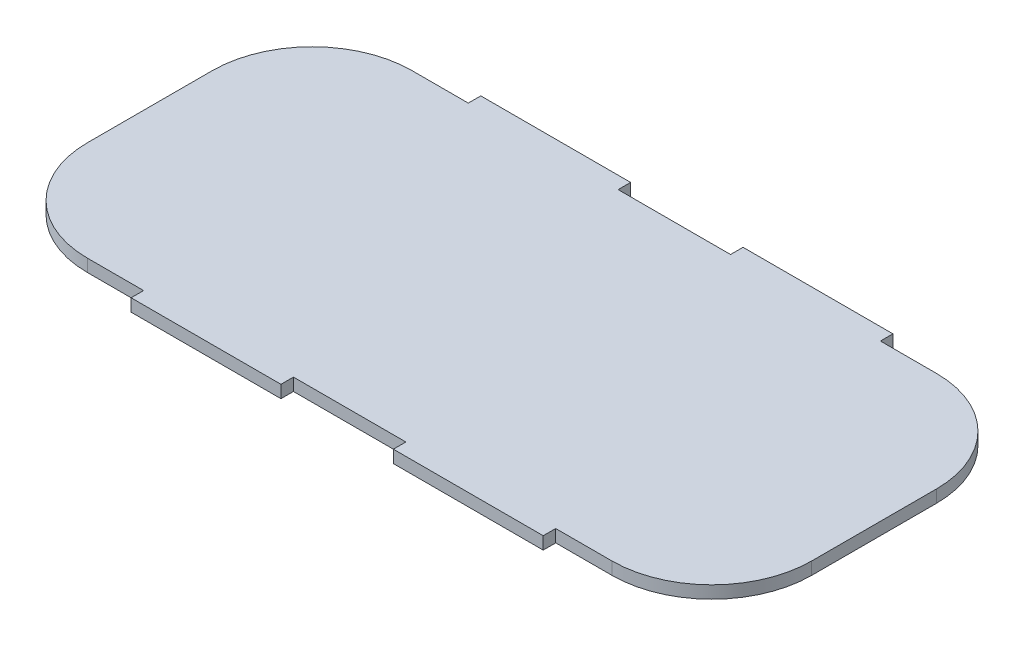
ISO-10303-21;
HEADER;
FILE_DESCRIPTION(('STEP AP214'),'2;1');
FILE_NAME('part.step','',(''),(''),'','','');
FILE_SCHEMA(('AUTOMOTIVE_DESIGN { 1 0 10303 214 1 1 1 1 }'));
ENDSEC;
DATA;
#1=APPLICATION_CONTEXT('core data for automotive mechanical design processes');
#2=APPLICATION_PROTOCOL_DEFINITION('international standard','automotive_design',2000,#1);
#3=PRODUCT_CONTEXT('',#1,'mechanical');
#4=PRODUCT('Part','Part','',(#3));
#5=PRODUCT_RELATED_PRODUCT_CATEGORY('part','',(#4));
#6=PRODUCT_DEFINITION_FORMATION('','',#4);
#7=PRODUCT_DEFINITION_CONTEXT('part definition',#1,'design');
#8=PRODUCT_DEFINITION('design','',#6,#7);
#9=PRODUCT_DEFINITION_SHAPE('','',#8);
#10=(LENGTH_UNIT() NAMED_UNIT(*) SI_UNIT(.MILLI.,.METRE.));
#11=(NAMED_UNIT(*) PLANE_ANGLE_UNIT() SI_UNIT($,.RADIAN.));
#12=(NAMED_UNIT(*) SI_UNIT($,.STERADIAN.) SOLID_ANGLE_UNIT());
#13=UNCERTAINTY_MEASURE_WITH_UNIT(LENGTH_MEASURE(1.E-05),#10,'distance_accuracy_value','');
#14=(GEOMETRIC_REPRESENTATION_CONTEXT(3) GLOBAL_UNCERTAINTY_ASSIGNED_CONTEXT((#13)) GLOBAL_UNIT_ASSIGNED_CONTEXT((#10,
#11,#12)) REPRESENTATION_CONTEXT('',''));
#15=CARTESIAN_POINT('',(0.,0.,0.));
#16=DIRECTION('',(0.,0.,1.));
#17=DIRECTION('',(1.,0.,0.));
#18=AXIS2_PLACEMENT_3D('',#15,#16,#17);
#19=CARTESIAN_POINT('',(52.5,2.5,-12.5));
#20=DIRECTION('',(0.,-1.,0.));
#21=DIRECTION('',(0.,0.,-1.));
#22=AXIS2_PLACEMENT_3D('',#19,#20,#21);
#23=CYLINDRICAL_SURFACE('',#22,20.);
#24=CARTESIAN_POINT('',(52.5,0.,-12.5));
#25=DIRECTION('',(0.,1.,0.));
#26=DIRECTION('',(0.,0.,-1.));
#27=AXIS2_PLACEMENT_3D('',#24,#25,#26);
#28=CIRCLE('',#27,20.);
#29=CARTESIAN_POINT('',(72.5,0.,-12.4999999999999));
#30=VERTEX_POINT('',#29);
#31=CARTESIAN_POINT('',(52.4999999999998,0.,-32.5));
#32=VERTEX_POINT('',#31);
#33=EDGE_CURVE('E236',#30,#32,#28,.T.);
#34=ORIENTED_EDGE('',*,*,#33,.T.);
#35=DIRECTION('',(0.,-1.,0.));
#36=VECTOR('',#35,1.);
#37=CARTESIAN_POINT('',(52.4999999999998,2.5,-32.5));
#38=LINE('',#37,#36);
#39=CARTESIAN_POINT('',(52.4999999999998,2.5,-32.5));
#40=VERTEX_POINT('',#39);
#41=EDGE_CURVE('E11',#40,#32,#38,.T.);
#42=ORIENTED_EDGE('',*,*,#41,.F.);
#43=CARTESIAN_POINT('',(52.5,2.5,-12.5));
#44=DIRECTION('',(0.,1.,0.));
#45=DIRECTION('',(0.,0.,-1.));
#46=AXIS2_PLACEMENT_3D('',#43,#44,#45);
#47=CIRCLE('',#46,20.);
#48=CARTESIAN_POINT('',(72.5,2.5,-12.4999999999999));
#49=VERTEX_POINT('',#48);
#50=EDGE_CURVE('E306',#49,#40,#47,.T.);
#51=ORIENTED_EDGE('',*,*,#50,.F.);
#52=DIRECTION('',(0.,-1.,0.));
#53=VECTOR('',#52,1.);
#54=CARTESIAN_POINT('',(72.5,2.5,-12.4999999999999));
#55=LINE('',#54,#53);
#56=EDGE_CURVE('E232',#49,#30,#55,.T.);
#57=ORIENTED_EDGE('',*,*,#56,.T.);
#58=EDGE_LOOP('',(#34,#42,#51,#57));
#59=FACE_BOUND('',#58,.T.);
#60=ADVANCED_FACE('F39',(#59),#23,.T.);
#61=CARTESIAN_POINT('',(41.2499999999997,2.5,-32.5));
#62=DIRECTION('',(0.,0.,1.));
#63=DIRECTION('',(1.,0.,0.));
#64=AXIS2_PLACEMENT_3D('',#61,#62,#63);
#65=PLANE('',#64);
#66=DIRECTION('',(-1.,0.,0.));
#67=VECTOR('',#66,1.);
#68=CARTESIAN_POINT('',(41.2499999999997,0.,-32.5));
#69=LINE('',#68,#67);
#70=CARTESIAN_POINT('',(41.2499999999997,0.,-32.5));
#71=VERTEX_POINT('',#70);
#72=EDGE_CURVE('E240',#32,#71,#69,.T.);
#73=ORIENTED_EDGE('',*,*,#72,.T.);
#74=DIRECTION('',(0.,-1.,0.));
#75=VECTOR('',#74,1.);
#76=CARTESIAN_POINT('',(41.2499999999997,2.5,-32.5));
#77=LINE('',#76,#75);
#78=CARTESIAN_POINT('',(41.2499999999997,2.5,-32.5));
#79=VERTEX_POINT('',#78);
#80=EDGE_CURVE('E48',#79,#71,#77,.T.);
#81=ORIENTED_EDGE('',*,*,#80,.F.);
#82=DIRECTION('',(-1.,0.,0.));
#83=VECTOR('',#82,1.);
#84=CARTESIAN_POINT('',(41.2499999999997,2.5,-32.5));
#85=LINE('',#84,#83);
#86=EDGE_CURVE('E147',#40,#79,#85,.T.);
#87=ORIENTED_EDGE('',*,*,#86,.F.);
#88=ORIENTED_EDGE('',*,*,#41,.T.);
#89=EDGE_LOOP('',(#73,#81,#87,#88));
#90=FACE_BOUND('',#89,.T.);
#91=ADVANCED_FACE('F484',(#90),#65,.F.);
#92=CARTESIAN_POINT('',(41.2499999999997,2.5,-35.0000000000003));
#93=DIRECTION('',(-1.,0.,0.));
#94=DIRECTION('',(0.,0.,1.));
#95=AXIS2_PLACEMENT_3D('',#92,#93,#94);
#96=PLANE('',#95);
#97=DIRECTION('',(0.,0.,-1.));
#98=VECTOR('',#97,1.);
#99=CARTESIAN_POINT('',(41.2499999999997,0.,-35.0000000000003));
#100=LINE('',#99,#98);
#101=CARTESIAN_POINT('',(41.2499999999997,0.,-35.0000000000003));
#102=VERTEX_POINT('',#101);
#103=EDGE_CURVE('E243',#71,#102,#100,.T.);
#104=ORIENTED_EDGE('',*,*,#103,.T.);
#105=DIRECTION('',(0.,-1.,0.));
#106=VECTOR('',#105,1.);
#107=CARTESIAN_POINT('',(41.2499999999997,2.5,-35.0000000000003));
#108=LINE('',#107,#106);
#109=CARTESIAN_POINT('',(41.2499999999997,2.5,-35.0000000000003));
#110=VERTEX_POINT('',#109);
#111=EDGE_CURVE('E381',#110,#102,#108,.T.);
#112=ORIENTED_EDGE('',*,*,#111,.F.);
#113=DIRECTION('',(0.,0.,-1.));
#114=VECTOR('',#113,1.);
#115=CARTESIAN_POINT('',(41.2499999999997,2.5,-35.0000000000003));
#116=LINE('',#115,#114);
#117=EDGE_CURVE('E391',#79,#110,#116,.T.);
#118=ORIENTED_EDGE('',*,*,#117,.F.);
#119=ORIENTED_EDGE('',*,*,#80,.T.);
#120=EDGE_LOOP('',(#104,#112,#118,#119));
#121=FACE_BOUND('',#120,.T.);
#122=ADVANCED_FACE('F389',(#121),#96,.F.);
#123=CARTESIAN_POINT('',(41.2499999999997,2.5,-35.0000000000003));
#124=DIRECTION('',(0.,0.,1.));
#125=DIRECTION('',(1.,0.,0.));
#126=AXIS2_PLACEMENT_3D('',#123,#124,#125);
#127=PLANE('',#126);
#128=DIRECTION('',(-1.,0.,0.));
#129=VECTOR('',#128,1.);
#130=CARTESIAN_POINT('',(41.2499999999997,0.,-35.0000000000003));
#131=LINE('',#130,#129);
#132=CARTESIAN_POINT('',(11.2499999999997,0.,-35.0000000000001));
#133=VERTEX_POINT('',#132);
#134=EDGE_CURVE('E246',#102,#133,#131,.T.);
#135=ORIENTED_EDGE('',*,*,#134,.T.);
#136=DIRECTION('',(0.,-1.,0.));
#137=VECTOR('',#136,1.);
#138=CARTESIAN_POINT('',(11.2499999999997,2.5,-35.0000000000001));
#139=LINE('',#138,#137);
#140=CARTESIAN_POINT('',(11.2499999999997,2.5,-35.0000000000001));
#141=VERTEX_POINT('',#140);
#142=EDGE_CURVE('E377',#141,#133,#139,.T.);
#143=ORIENTED_EDGE('',*,*,#142,.F.);
#144=DIRECTION('',(-1.,0.,0.));
#145=VECTOR('',#144,1.);
#146=CARTESIAN_POINT('',(41.2499999999997,2.5,-35.0000000000003));
#147=LINE('',#146,#145);
#148=EDGE_CURVE('E410',#110,#141,#147,.T.);
#149=ORIENTED_EDGE('',*,*,#148,.F.);
#150=ORIENTED_EDGE('',*,*,#111,.T.);
#151=EDGE_LOOP('',(#135,#143,#149,#150));
#152=FACE_BOUND('',#151,.T.);
#153=ADVANCED_FACE('F400',(#152),#127,.F.);
#154=CARTESIAN_POINT('',(11.2499999999997,2.5,-35.0000000000001));
#155=DIRECTION('',(1.,0.,0.));
#156=DIRECTION('',(0.,0.,-1.));
#157=AXIS2_PLACEMENT_3D('',#154,#155,#156);
#158=PLANE('',#157);
#159=DIRECTION('',(0.,0.,1.));
#160=VECTOR('',#159,1.);
#161=CARTESIAN_POINT('',(11.2499999999997,0.,-35.0000000000001));
#162=LINE('',#161,#160);
#163=CARTESIAN_POINT('',(11.2499999999997,0.,-32.5));
#164=VERTEX_POINT('',#163);
#165=EDGE_CURVE('E249',#133,#164,#162,.T.);
#166=ORIENTED_EDGE('',*,*,#165,.T.);
#167=DIRECTION('',(0.,-1.,0.));
#168=VECTOR('',#167,1.);
#169=CARTESIAN_POINT('',(11.2499999999997,2.5,-32.5));
#170=LINE('',#169,#168);
#171=CARTESIAN_POINT('',(11.2499999999997,2.5,-32.5));
#172=VERTEX_POINT('',#171);
#173=EDGE_CURVE('E373',#172,#164,#170,.T.);
#174=ORIENTED_EDGE('',*,*,#173,.F.);
#175=DIRECTION('',(0.,0.,1.));
#176=VECTOR('',#175,1.);
#177=CARTESIAN_POINT('',(11.2499999999997,2.5,-35.0000000000001));
#178=LINE('',#177,#176);
#179=EDGE_CURVE('E406',#141,#172,#178,.T.);
#180=ORIENTED_EDGE('',*,*,#179,.F.);
#181=ORIENTED_EDGE('',*,*,#142,.T.);
#182=EDGE_LOOP('',(#166,#174,#180,#181));
#183=FACE_BOUND('',#182,.T.);
#184=ADVANCED_FACE('F404',(#183),#158,.F.);
#185=CARTESIAN_POINT('',(-11.25,2.5,-32.5));
#186=DIRECTION('',(0.,0.,1.));
#187=DIRECTION('',(1.,0.,0.));
#188=AXIS2_PLACEMENT_3D('',#185,#186,#187);
#189=PLANE('',#188);
#190=DIRECTION('',(-1.,0.,0.));
#191=VECTOR('',#190,1.);
#192=CARTESIAN_POINT('',(-11.25,0.,-32.5));
#193=LINE('',#192,#191);
#194=CARTESIAN_POINT('',(-11.25,0.,-32.5));
#195=VERTEX_POINT('',#194);
#196=EDGE_CURVE('E252',#164,#195,#193,.T.);
#197=ORIENTED_EDGE('',*,*,#196,.T.);
#198=DIRECTION('',(0.,-1.,0.));
#199=VECTOR('',#198,1.);
#200=CARTESIAN_POINT('',(-11.25,2.5,-32.5));
#201=LINE('',#200,#199);
#202=CARTESIAN_POINT('',(-11.25,2.5,-32.5));
#203=VERTEX_POINT('',#202);
#204=EDGE_CURVE('E369',#203,#195,#201,.T.);
#205=ORIENTED_EDGE('',*,*,#204,.F.);
#206=DIRECTION('',(-1.,0.,0.));
#207=VECTOR('',#206,1.);
#208=CARTESIAN_POINT('',(-11.25,2.5,-32.5));
#209=LINE('',#208,#207);
#210=EDGE_CURVE('E409',#172,#203,#209,.T.);
#211=ORIENTED_EDGE('',*,*,#210,.F.);
#212=ORIENTED_EDGE('',*,*,#173,.T.);
#213=EDGE_LOOP('',(#197,#205,#211,#212));
#214=FACE_BOUND('',#213,.T.);
#215=ADVANCED_FACE('F497',(#214),#189,.F.);
#216=CARTESIAN_POINT('',(-11.25,2.5,-35.));
#217=DIRECTION('',(-1.,0.,0.));
#218=DIRECTION('',(0.,0.,1.));
#219=AXIS2_PLACEMENT_3D('',#216,#217,#218);
#220=PLANE('',#219);
#221=DIRECTION('',(0.,0.,-1.));
#222=VECTOR('',#221,1.);
#223=CARTESIAN_POINT('',(-11.25,0.,-35.));
#224=LINE('',#223,#222);
#225=CARTESIAN_POINT('',(-11.25,0.,-35.));
#226=VERTEX_POINT('',#225);
#227=EDGE_CURVE('E255',#195,#226,#224,.T.);
#228=ORIENTED_EDGE('',*,*,#227,.T.);
#229=DIRECTION('',(0.,-1.,0.));
#230=VECTOR('',#229,1.);
#231=CARTESIAN_POINT('',(-11.25,2.5,-35.));
#232=LINE('',#231,#230);
#233=CARTESIAN_POINT('',(-11.25,2.5,-35.));
#234=VERTEX_POINT('',#233);
#235=EDGE_CURVE('E365',#234,#226,#232,.T.);
#236=ORIENTED_EDGE('',*,*,#235,.F.);
#237=DIRECTION('',(0.,0.,-1.));
#238=VECTOR('',#237,1.);
#239=CARTESIAN_POINT('',(-11.25,2.5,-35.));
#240=LINE('',#239,#238);
#241=EDGE_CURVE('E414',#203,#234,#240,.T.);
#242=ORIENTED_EDGE('',*,*,#241,.F.);
#243=ORIENTED_EDGE('',*,*,#204,.T.);
#244=EDGE_LOOP('',(#228,#236,#242,#243));
#245=FACE_BOUND('',#244,.T.);
#246=ADVANCED_FACE('F500',(#245),#220,.F.);
#247=CARTESIAN_POINT('',(-41.25,2.5,-35.));
#248=DIRECTION('',(0.,0.,1.));
#249=DIRECTION('',(1.,0.,0.));
#250=AXIS2_PLACEMENT_3D('',#247,#248,#249);
#251=PLANE('',#250);
#252=DIRECTION('',(-1.,0.,0.));
#253=VECTOR('',#252,1.);
#254=CARTESIAN_POINT('',(-41.25,0.,-35.));
#255=LINE('',#254,#253);
#256=CARTESIAN_POINT('',(-41.25,0.,-35.));
#257=VERTEX_POINT('',#256);
#258=EDGE_CURVE('E258',#226,#257,#255,.T.);
#259=ORIENTED_EDGE('',*,*,#258,.T.);
#260=DIRECTION('',(0.,-1.,0.));
#261=VECTOR('',#260,1.);
#262=CARTESIAN_POINT('',(-41.25,2.5,-35.));
#263=LINE('',#262,#261);
#264=CARTESIAN_POINT('',(-41.25,2.5,-35.));
#265=VERTEX_POINT('',#264);
#266=EDGE_CURVE('E361',#265,#257,#263,.T.);
#267=ORIENTED_EDGE('',*,*,#266,.F.);
#268=DIRECTION('',(-1.,0.,0.));
#269=VECTOR('',#268,1.);
#270=CARTESIAN_POINT('',(-41.25,2.5,-35.));
#271=LINE('',#270,#269);
#272=EDGE_CURVE('E421',#234,#265,#271,.T.);
#273=ORIENTED_EDGE('',*,*,#272,.F.);
#274=ORIENTED_EDGE('',*,*,#235,.T.);
#275=EDGE_LOOP('',(#259,#267,#273,#274));
#276=FACE_BOUND('',#275,.T.);
#277=ADVANCED_FACE('F504',(#276),#251,.F.);
#278=CARTESIAN_POINT('',(-41.25,2.5,-35.));
#279=DIRECTION('',(1.,0.,0.));
#280=DIRECTION('',(0.,0.,-1.));
#281=AXIS2_PLACEMENT_3D('',#278,#279,#280);
#282=PLANE('',#281);
#283=DIRECTION('',(0.,0.,1.));
#284=VECTOR('',#283,1.);
#285=CARTESIAN_POINT('',(-41.25,0.,-35.));
#286=LINE('',#285,#284);
#287=CARTESIAN_POINT('',(-41.25,0.,-32.5));
#288=VERTEX_POINT('',#287);
#289=EDGE_CURVE('E261',#257,#288,#286,.T.);
#290=ORIENTED_EDGE('',*,*,#289,.T.);
#291=DIRECTION('',(0.,-1.,0.));
#292=VECTOR('',#291,1.);
#293=CARTESIAN_POINT('',(-41.25,2.5,-32.5));
#294=LINE('',#293,#292);
#295=CARTESIAN_POINT('',(-41.25,2.5,-32.5));
#296=VERTEX_POINT('',#295);
#297=EDGE_CURVE('E357',#296,#288,#294,.T.);
#298=ORIENTED_EDGE('',*,*,#297,.F.);
#299=DIRECTION('',(0.,0.,1.));
#300=VECTOR('',#299,1.);
#301=CARTESIAN_POINT('',(-41.25,2.5,-35.));
#302=LINE('',#301,#300);
#303=EDGE_CURVE('E424',#265,#296,#302,.T.);
#304=ORIENTED_EDGE('',*,*,#303,.F.);
#305=ORIENTED_EDGE('',*,*,#266,.T.);
#306=EDGE_LOOP('',(#290,#298,#304,#305));
#307=FACE_BOUND('',#306,.T.);
#308=ADVANCED_FACE('F508',(#307),#282,.F.);
#309=CARTESIAN_POINT('',(-52.4999999999999,2.5,-32.5));
#310=DIRECTION('',(0.,0.,1.));
#311=DIRECTION('',(1.,0.,0.));
#312=AXIS2_PLACEMENT_3D('',#309,#310,#311);
#313=PLANE('',#312);
#314=DIRECTION('',(-1.,0.,0.));
#315=VECTOR('',#314,1.);
#316=CARTESIAN_POINT('',(-52.4999999999999,0.,-32.5));
#317=LINE('',#316,#315);
#318=CARTESIAN_POINT('',(-52.4999999999999,0.,-32.5));
#319=VERTEX_POINT('',#318);
#320=EDGE_CURVE('E264',#288,#319,#317,.T.);
#321=ORIENTED_EDGE('',*,*,#320,.T.);
#322=DIRECTION('',(0.,-1.,0.));
#323=VECTOR('',#322,1.);
#324=CARTESIAN_POINT('',(-52.4999999999999,2.5,-32.5));
#325=LINE('',#324,#323);
#326=CARTESIAN_POINT('',(-52.4999999999999,2.5,-32.5));
#327=VERTEX_POINT('',#326);
#328=EDGE_CURVE('E353',#327,#319,#325,.T.);
#329=ORIENTED_EDGE('',*,*,#328,.F.);
#330=DIRECTION('',(-1.,0.,0.));
#331=VECTOR('',#330,1.);
#332=CARTESIAN_POINT('',(-52.4999999999999,2.5,-32.5));
#333=LINE('',#332,#331);
#334=EDGE_CURVE('E427',#296,#327,#333,.T.);
#335=ORIENTED_EDGE('',*,*,#334,.F.);
#336=ORIENTED_EDGE('',*,*,#297,.T.);
#337=EDGE_LOOP('',(#321,#329,#335,#336));
#338=FACE_BOUND('',#337,.T.);
#339=ADVANCED_FACE('F512',(#338),#313,.F.);
#340=CARTESIAN_POINT('',(-52.5,2.5,-12.5));
#341=DIRECTION('',(0.,-1.,0.));
#342=DIRECTION('',(0.,0.,-1.));
#343=AXIS2_PLACEMENT_3D('',#340,#341,#342);
#344=CYLINDRICAL_SURFACE('',#343,20.);
#345=CARTESIAN_POINT('',(-52.5,0.,-12.5));
#346=DIRECTION('',(0.,1.,0.));
#347=DIRECTION('',(0.,0.,-1.));
#348=AXIS2_PLACEMENT_3D('',#345,#346,#347);
#349=CIRCLE('',#348,20.);
#350=CARTESIAN_POINT('',(-72.5,0.,-12.4999999999999));
#351=VERTEX_POINT('',#350);
#352=EDGE_CURVE('E267',#319,#351,#349,.T.);
#353=ORIENTED_EDGE('',*,*,#352,.T.);
#354=DIRECTION('',(0.,-1.,0.));
#355=VECTOR('',#354,1.);
#356=CARTESIAN_POINT('',(-72.5,2.5,-12.4999999999999));
#357=LINE('',#356,#355);
#358=CARTESIAN_POINT('',(-72.5,2.5,-12.4999999999999));
#359=VERTEX_POINT('',#358);
#360=EDGE_CURVE('E349',#359,#351,#357,.T.);
#361=ORIENTED_EDGE('',*,*,#360,.F.);
#362=CARTESIAN_POINT('',(-52.5,2.5,-12.5));
#363=DIRECTION('',(0.,1.,0.));
#364=DIRECTION('',(0.,0.,-1.));
#365=AXIS2_PLACEMENT_3D('',#362,#363,#364);
#366=CIRCLE('',#365,20.);
#367=EDGE_CURVE('E430',#327,#359,#366,.T.);
#368=ORIENTED_EDGE('',*,*,#367,.F.);
#369=ORIENTED_EDGE('',*,*,#328,.T.);
#370=EDGE_LOOP('',(#353,#361,#368,#369));
#371=FACE_BOUND('',#370,.T.);
#372=ADVANCED_FACE('F516',(#371),#344,.T.);
#373=CARTESIAN_POINT('',(-72.5,2.5,-12.4999999999999));
#374=DIRECTION('',(1.,0.,0.));
#375=DIRECTION('',(0.,0.,-1.));
#376=AXIS2_PLACEMENT_3D('',#373,#374,#375);
#377=PLANE('',#376);
#378=DIRECTION('',(0.,0.,1.));
#379=VECTOR('',#378,1.);
#380=CARTESIAN_POINT('',(-72.5,0.,-12.4999999999999));
#381=LINE('',#380,#379);
#382=CARTESIAN_POINT('',(-72.5,0.,12.4999999999999));
#383=VERTEX_POINT('',#382);
#384=EDGE_CURVE('E270',#351,#383,#381,.T.);
#385=ORIENTED_EDGE('',*,*,#384,.T.);
#386=DIRECTION('',(0.,-1.,0.));
#387=VECTOR('',#386,1.);
#388=CARTESIAN_POINT('',(-72.5,2.5,12.4999999999999));
#389=LINE('',#388,#387);
#390=CARTESIAN_POINT('',(-72.5,2.5,12.4999999999999));
#391=VERTEX_POINT('',#390);
#392=EDGE_CURVE('E345',#391,#383,#389,.T.);
#393=ORIENTED_EDGE('',*,*,#392,.F.);
#394=DIRECTION('',(0.,0.,1.));
#395=VECTOR('',#394,1.);
#396=CARTESIAN_POINT('',(-72.5,2.5,-12.4999999999999));
#397=LINE('',#396,#395);
#398=EDGE_CURVE('E433',#359,#391,#397,.T.);
#399=ORIENTED_EDGE('',*,*,#398,.F.);
#400=ORIENTED_EDGE('',*,*,#360,.T.);
#401=EDGE_LOOP('',(#385,#393,#399,#400));
#402=FACE_BOUND('',#401,.T.);
#403=ADVANCED_FACE('F520',(#402),#377,.F.);
#404=CARTESIAN_POINT('',(-52.5,2.5,12.5));
#405=DIRECTION('',(0.,-1.,0.));
#406=DIRECTION('',(0.,0.,-1.));
#407=AXIS2_PLACEMENT_3D('',#404,#405,#406);
#408=CYLINDRICAL_SURFACE('',#407,20.);
#409=CARTESIAN_POINT('',(-52.5,0.,12.5));
#410=DIRECTION('',(0.,1.,0.));
#411=DIRECTION('',(0.,0.,-1.));
#412=AXIS2_PLACEMENT_3D('',#409,#410,#411);
#413=CIRCLE('',#412,20.);
#414=CARTESIAN_POINT('',(-52.4999999999999,0.,32.5));
#415=VERTEX_POINT('',#414);
#416=EDGE_CURVE('E273',#383,#415,#413,.T.);
#417=ORIENTED_EDGE('',*,*,#416,.T.);
#418=DIRECTION('',(0.,-1.,0.));
#419=VECTOR('',#418,1.);
#420=CARTESIAN_POINT('',(-52.4999999999999,2.5,32.5));
#421=LINE('',#420,#419);
#422=CARTESIAN_POINT('',(-52.4999999999999,2.5,32.5));
#423=VERTEX_POINT('',#422);
#424=EDGE_CURVE('E341',#423,#415,#421,.T.);
#425=ORIENTED_EDGE('',*,*,#424,.F.);
#426=CARTESIAN_POINT('',(-52.5,2.5,12.5));
#427=DIRECTION('',(0.,1.,0.));
#428=DIRECTION('',(0.,0.,-1.));
#429=AXIS2_PLACEMENT_3D('',#426,#427,#428);
#430=CIRCLE('',#429,20.);
#431=EDGE_CURVE('E436',#391,#423,#430,.T.);
#432=ORIENTED_EDGE('',*,*,#431,.F.);
#433=ORIENTED_EDGE('',*,*,#392,.T.);
#434=EDGE_LOOP('',(#417,#425,#432,#433));
#435=FACE_BOUND('',#434,.T.);
#436=ADVANCED_FACE('F524',(#435),#408,.T.);
#437=CARTESIAN_POINT('',(-52.4999999999999,2.5,32.5));
#438=DIRECTION('',(0.,0.,-1.));
#439=DIRECTION('',(-1.,0.,0.));
#440=AXIS2_PLACEMENT_3D('',#437,#438,#439);
#441=PLANE('',#440);
#442=DIRECTION('',(1.,0.,0.));
#443=VECTOR('',#442,1.);
#444=CARTESIAN_POINT('',(-52.4999999999999,0.,32.5));
#445=LINE('',#444,#443);
#446=CARTESIAN_POINT('',(-41.25,0.,32.5));
#447=VERTEX_POINT('',#446);
#448=EDGE_CURVE('E276',#415,#447,#445,.T.);
#449=ORIENTED_EDGE('',*,*,#448,.T.);
#450=DIRECTION('',(0.,-1.,0.));
#451=VECTOR('',#450,1.);
#452=CARTESIAN_POINT('',(-41.25,2.5,32.5));
#453=LINE('',#452,#451);
#454=CARTESIAN_POINT('',(-41.25,2.5,32.5));
#455=VERTEX_POINT('',#454);
#456=EDGE_CURVE('E337',#455,#447,#453,.T.);
#457=ORIENTED_EDGE('',*,*,#456,.F.);
#458=DIRECTION('',(1.,0.,0.));
#459=VECTOR('',#458,1.);
#460=CARTESIAN_POINT('',(-52.4999999999999,2.5,32.5));
#461=LINE('',#460,#459);
#462=EDGE_CURVE('E439',#423,#455,#461,.T.);
#463=ORIENTED_EDGE('',*,*,#462,.F.);
#464=ORIENTED_EDGE('',*,*,#424,.T.);
#465=EDGE_LOOP('',(#449,#457,#463,#464));
#466=FACE_BOUND('',#465,.T.);
#467=ADVANCED_FACE('F528',(#466),#441,.F.);
#468=CARTESIAN_POINT('',(-41.25,2.5,35.));
#469=DIRECTION('',(1.,0.,0.));
#470=DIRECTION('',(0.,0.,-1.));
#471=AXIS2_PLACEMENT_3D('',#468,#469,#470);
#472=PLANE('',#471);
#473=DIRECTION('',(0.,0.,1.));
#474=VECTOR('',#473,1.);
#475=CARTESIAN_POINT('',(-41.25,0.,35.));
#476=LINE('',#475,#474);
#477=CARTESIAN_POINT('',(-41.25,0.,35.));
#478=VERTEX_POINT('',#477);
#479=EDGE_CURVE('E279',#447,#478,#476,.T.);
#480=ORIENTED_EDGE('',*,*,#479,.T.);
#481=DIRECTION('',(0.,-1.,0.));
#482=VECTOR('',#481,1.);
#483=CARTESIAN_POINT('',(-41.25,2.5,35.));
#484=LINE('',#483,#482);
#485=CARTESIAN_POINT('',(-41.25,2.5,35.));
#486=VERTEX_POINT('',#485);
#487=EDGE_CURVE('E333',#486,#478,#484,.T.);
#488=ORIENTED_EDGE('',*,*,#487,.F.);
#489=DIRECTION('',(0.,0.,1.));
#490=VECTOR('',#489,1.);
#491=CARTESIAN_POINT('',(-41.25,2.5,35.));
#492=LINE('',#491,#490);
#493=EDGE_CURVE('E442',#455,#486,#492,.T.);
#494=ORIENTED_EDGE('',*,*,#493,.F.);
#495=ORIENTED_EDGE('',*,*,#456,.T.);
#496=EDGE_LOOP('',(#480,#488,#494,#495));
#497=FACE_BOUND('',#496,.T.);
#498=ADVANCED_FACE('F532',(#497),#472,.F.);
#499=CARTESIAN_POINT('',(-41.25,2.5,35.));
#500=DIRECTION('',(0.,0.,-1.));
#501=DIRECTION('',(-1.,0.,0.));
#502=AXIS2_PLACEMENT_3D('',#499,#500,#501);
#503=PLANE('',#502);
#504=DIRECTION('',(1.,0.,0.));
#505=VECTOR('',#504,1.);
#506=CARTESIAN_POINT('',(-41.25,0.,35.));
#507=LINE('',#506,#505);
#508=CARTESIAN_POINT('',(-11.25,0.,35.));
#509=VERTEX_POINT('',#508);
#510=EDGE_CURVE('E282',#478,#509,#507,.T.);
#511=ORIENTED_EDGE('',*,*,#510,.T.);
#512=DIRECTION('',(0.,-1.,0.));
#513=VECTOR('',#512,1.);
#514=CARTESIAN_POINT('',(-11.25,2.5,35.));
#515=LINE('',#514,#513);
#516=CARTESIAN_POINT('',(-11.25,2.5,35.));
#517=VERTEX_POINT('',#516);
#518=EDGE_CURVE('E329',#517,#509,#515,.T.);
#519=ORIENTED_EDGE('',*,*,#518,.F.);
#520=DIRECTION('',(1.,0.,0.));
#521=VECTOR('',#520,1.);
#522=CARTESIAN_POINT('',(-41.25,2.5,35.));
#523=LINE('',#522,#521);
#524=EDGE_CURVE('E445',#486,#517,#523,.T.);
#525=ORIENTED_EDGE('',*,*,#524,.F.);
#526=ORIENTED_EDGE('',*,*,#487,.T.);
#527=EDGE_LOOP('',(#511,#519,#525,#526));
#528=FACE_BOUND('',#527,.T.);
#529=ADVANCED_FACE('F536',(#528),#503,.F.);
#530=CARTESIAN_POINT('',(-11.25,2.5,35.));
#531=DIRECTION('',(-1.,0.,0.));
#532=DIRECTION('',(0.,0.,1.));
#533=AXIS2_PLACEMENT_3D('',#530,#531,#532);
#534=PLANE('',#533);
#535=DIRECTION('',(0.,0.,-1.));
#536=VECTOR('',#535,1.);
#537=CARTESIAN_POINT('',(-11.25,0.,35.));
#538=LINE('',#537,#536);
#539=CARTESIAN_POINT('',(-11.25,0.,32.5));
#540=VERTEX_POINT('',#539);
#541=EDGE_CURVE('E285',#509,#540,#538,.T.);
#542=ORIENTED_EDGE('',*,*,#541,.T.);
#543=DIRECTION('',(0.,-1.,0.));
#544=VECTOR('',#543,1.);
#545=CARTESIAN_POINT('',(-11.25,2.5,32.5));
#546=LINE('',#545,#544);
#547=CARTESIAN_POINT('',(-11.25,2.5,32.5));
#548=VERTEX_POINT('',#547);
#549=EDGE_CURVE('E325',#548,#540,#546,.T.);
#550=ORIENTED_EDGE('',*,*,#549,.F.);
#551=DIRECTION('',(0.,0.,-1.));
#552=VECTOR('',#551,1.);
#553=CARTESIAN_POINT('',(-11.25,2.5,35.));
#554=LINE('',#553,#552);
#555=EDGE_CURVE('E448',#517,#548,#554,.T.);
#556=ORIENTED_EDGE('',*,*,#555,.F.);
#557=ORIENTED_EDGE('',*,*,#518,.T.);
#558=EDGE_LOOP('',(#542,#550,#556,#557));
#559=FACE_BOUND('',#558,.T.);
#560=ADVANCED_FACE('F540',(#559),#534,.F.);
#561=CARTESIAN_POINT('',(-11.25,2.5,32.5));
#562=DIRECTION('',(0.,0.,-1.));
#563=DIRECTION('',(-1.,0.,0.));
#564=AXIS2_PLACEMENT_3D('',#561,#562,#563);
#565=PLANE('',#564);
#566=DIRECTION('',(1.,0.,0.));
#567=VECTOR('',#566,1.);
#568=CARTESIAN_POINT('',(-11.25,0.,32.5));
#569=LINE('',#568,#567);
#570=CARTESIAN_POINT('',(11.2500000000002,0.,32.5));
#571=VERTEX_POINT('',#570);
#572=EDGE_CURVE('E288',#540,#571,#569,.T.);
#573=ORIENTED_EDGE('',*,*,#572,.T.);
#574=DIRECTION('',(0.,-1.,0.));
#575=VECTOR('',#574,1.);
#576=CARTESIAN_POINT('',(11.2500000000002,2.5,32.5));
#577=LINE('',#576,#575);
#578=CARTESIAN_POINT('',(11.2500000000002,2.5,32.5));
#579=VERTEX_POINT('',#578);
#580=EDGE_CURVE('E321',#579,#571,#577,.T.);
#581=ORIENTED_EDGE('',*,*,#580,.F.);
#582=DIRECTION('',(1.,0.,0.));
#583=VECTOR('',#582,1.);
#584=CARTESIAN_POINT('',(-11.25,2.5,32.5));
#585=LINE('',#584,#583);
#586=EDGE_CURVE('E451',#548,#579,#585,.T.);
#587=ORIENTED_EDGE('',*,*,#586,.F.);
#588=ORIENTED_EDGE('',*,*,#549,.T.);
#589=EDGE_LOOP('',(#573,#581,#587,#588));
#590=FACE_BOUND('',#589,.T.);
#591=ADVANCED_FACE('F544',(#590),#565,.F.);
#592=CARTESIAN_POINT('',(11.2500000000002,2.5,34.9999999999999));
#593=DIRECTION('',(1.,0.,0.));
#594=DIRECTION('',(0.,0.,-1.));
#595=AXIS2_PLACEMENT_3D('',#592,#593,#594);
#596=PLANE('',#595);
#597=DIRECTION('',(0.,0.,1.));
#598=VECTOR('',#597,1.);
#599=CARTESIAN_POINT('',(11.2500000000002,0.,34.9999999999999));
#600=LINE('',#599,#598);
#601=CARTESIAN_POINT('',(11.2500000000002,0.,34.9999999999999));
#602=VERTEX_POINT('',#601);
#603=EDGE_CURVE('E291',#571,#602,#600,.T.);
#604=ORIENTED_EDGE('',*,*,#603,.T.);
#605=DIRECTION('',(0.,-1.,0.));
#606=VECTOR('',#605,1.);
#607=CARTESIAN_POINT('',(11.2500000000002,2.5,34.9999999999999));
#608=LINE('',#607,#606);
#609=CARTESIAN_POINT('',(11.2500000000002,2.5,34.9999999999999));
#610=VERTEX_POINT('',#609);
#611=EDGE_CURVE('E317',#610,#602,#608,.T.);
#612=ORIENTED_EDGE('',*,*,#611,.F.);
#613=DIRECTION('',(0.,0.,1.));
#614=VECTOR('',#613,1.);
#615=CARTESIAN_POINT('',(11.2500000000002,2.5,34.9999999999999));
#616=LINE('',#615,#614);
#617=EDGE_CURVE('E454',#579,#610,#616,.T.);
#618=ORIENTED_EDGE('',*,*,#617,.F.);
#619=ORIENTED_EDGE('',*,*,#580,.T.);
#620=EDGE_LOOP('',(#604,#612,#618,#619));
#621=FACE_BOUND('',#620,.T.);
#622=ADVANCED_FACE('F548',(#621),#596,.F.);
#623=CARTESIAN_POINT('',(41.2500000000002,2.5,34.9999999999997));
#624=DIRECTION('',(0.,0.,-1.));
#625=DIRECTION('',(-1.,0.,0.));
#626=AXIS2_PLACEMENT_3D('',#623,#624,#625);
#627=PLANE('',#626);
#628=DIRECTION('',(1.,0.,0.));
#629=VECTOR('',#628,1.);
#630=CARTESIAN_POINT('',(41.2500000000002,0.,34.9999999999997));
#631=LINE('',#630,#629);
#632=CARTESIAN_POINT('',(41.2500000000002,0.,34.9999999999997));
#633=VERTEX_POINT('',#632);
#634=EDGE_CURVE('E294',#602,#633,#631,.T.);
#635=ORIENTED_EDGE('',*,*,#634,.T.);
#636=DIRECTION('',(0.,-1.,0.));
#637=VECTOR('',#636,1.);
#638=CARTESIAN_POINT('',(41.2500000000002,2.5,34.9999999999997));
#639=LINE('',#638,#637);
#640=CARTESIAN_POINT('',(41.2500000000002,2.5,34.9999999999997));
#641=VERTEX_POINT('',#640);
#642=EDGE_CURVE('E313',#641,#633,#639,.T.);
#643=ORIENTED_EDGE('',*,*,#642,.F.);
#644=DIRECTION('',(1.,0.,0.));
#645=VECTOR('',#644,1.);
#646=CARTESIAN_POINT('',(41.2500000000002,2.5,34.9999999999997));
#647=LINE('',#646,#645);
#648=EDGE_CURVE('E457',#610,#641,#647,.T.);
#649=ORIENTED_EDGE('',*,*,#648,.F.);
#650=ORIENTED_EDGE('',*,*,#611,.T.);
#651=EDGE_LOOP('',(#635,#643,#649,#650));
#652=FACE_BOUND('',#651,.T.);
#653=ADVANCED_FACE('F465',(#652),#627,.F.);
#654=CARTESIAN_POINT('',(41.2500000000002,2.5,34.9999999999997));
#655=DIRECTION('',(-1.,0.,0.));
#656=DIRECTION('',(0.,0.,1.));
#657=AXIS2_PLACEMENT_3D('',#654,#655,#656);
#658=PLANE('',#657);
#659=DIRECTION('',(0.,0.,-1.));
#660=VECTOR('',#659,1.);
#661=CARTESIAN_POINT('',(41.2500000000002,0.,34.9999999999997));
#662=LINE('',#661,#660);
#663=CARTESIAN_POINT('',(41.2500000000002,0.,32.5));
#664=VERTEX_POINT('',#663);
#665=EDGE_CURVE('E297',#633,#664,#662,.T.);
#666=ORIENTED_EDGE('',*,*,#665,.T.);
#667=DIRECTION('',(0.,-1.,0.));
#668=VECTOR('',#667,1.);
#669=CARTESIAN_POINT('',(41.2500000000002,2.5,32.5));
#670=LINE('',#669,#668);
#671=CARTESIAN_POINT('',(41.2500000000002,2.5,32.5));
#672=VERTEX_POINT('',#671);
#673=EDGE_CURVE('E225',#672,#664,#670,.T.);
#674=ORIENTED_EDGE('',*,*,#673,.F.);
#675=DIRECTION('',(0.,0.,-1.));
#676=VECTOR('',#675,1.);
#677=CARTESIAN_POINT('',(41.2500000000002,2.5,34.9999999999997));
#678=LINE('',#677,#676);
#679=EDGE_CURVE('E214',#641,#672,#678,.T.);
#680=ORIENTED_EDGE('',*,*,#679,.F.);
#681=ORIENTED_EDGE('',*,*,#642,.T.);
#682=EDGE_LOOP('',(#666,#674,#680,#681));
#683=FACE_BOUND('',#682,.T.);
#684=ADVANCED_FACE('F469',(#683),#658,.F.);
#685=CARTESIAN_POINT('',(41.2500000000002,2.5,32.5));
#686=DIRECTION('',(0.,0.,-1.));
#687=DIRECTION('',(-1.,0.,0.));
#688=AXIS2_PLACEMENT_3D('',#685,#686,#687);
#689=PLANE('',#688);
#690=DIRECTION('',(1.,0.,0.));
#691=VECTOR('',#690,1.);
#692=CARTESIAN_POINT('',(41.2500000000002,0.,32.5));
#693=LINE('',#692,#691);
#694=CARTESIAN_POINT('',(52.4999999999998,0.,32.5));
#695=VERTEX_POINT('',#694);
#696=EDGE_CURVE('E223',#664,#695,#693,.T.);
#697=ORIENTED_EDGE('',*,*,#696,.T.);
#698=DIRECTION('',(0.,-1.,0.));
#699=VECTOR('',#698,1.);
#700=CARTESIAN_POINT('',(52.4999999999998,2.5,32.5));
#701=LINE('',#700,#699);
#702=CARTESIAN_POINT('',(52.4999999999998,2.5,32.5));
#703=VERTEX_POINT('',#702);
#704=EDGE_CURVE('E220',#703,#695,#701,.T.);
#705=ORIENTED_EDGE('',*,*,#704,.F.);
#706=DIRECTION('',(1.,0.,0.));
#707=VECTOR('',#706,1.);
#708=CARTESIAN_POINT('',(41.2500000000002,2.5,32.5));
#709=LINE('',#708,#707);
#710=EDGE_CURVE('E208',#672,#703,#709,.T.);
#711=ORIENTED_EDGE('',*,*,#710,.F.);
#712=ORIENTED_EDGE('',*,*,#673,.T.);
#713=EDGE_LOOP('',(#697,#705,#711,#712));
#714=FACE_BOUND('',#713,.T.);
#715=ADVANCED_FACE('F221',(#714),#689,.F.);
#716=CARTESIAN_POINT('',(52.5,2.5,12.5));
#717=DIRECTION('',(0.,-1.,0.));
#718=DIRECTION('',(0.,0.,-1.));
#719=AXIS2_PLACEMENT_3D('',#716,#717,#718);
#720=CYLINDRICAL_SURFACE('',#719,20.);
#721=CARTESIAN_POINT('',(52.5,0.,12.5));
#722=DIRECTION('',(0.,1.,0.));
#723=DIRECTION('',(0.,0.,-1.));
#724=AXIS2_PLACEMENT_3D('',#721,#722,#723);
#725=CIRCLE('',#724,20.);
#726=CARTESIAN_POINT('',(72.5,0.,12.4999999999999));
#727=VERTEX_POINT('',#726);
#728=EDGE_CURVE('E133',#695,#727,#725,.T.);
#729=ORIENTED_EDGE('',*,*,#728,.T.);
#730=DIRECTION('',(0.,-1.,0.));
#731=VECTOR('',#730,1.);
#732=CARTESIAN_POINT('',(72.5,2.5,12.4999999999999));
#733=LINE('',#732,#731);
#734=CARTESIAN_POINT('',(72.5,2.5,12.4999999999999));
#735=VERTEX_POINT('',#734);
#736=EDGE_CURVE('E226',#735,#727,#733,.T.);
#737=ORIENTED_EDGE('',*,*,#736,.F.);
#738=CARTESIAN_POINT('',(52.5,2.5,12.5));
#739=DIRECTION('',(0.,1.,0.));
#740=DIRECTION('',(0.,0.,-1.));
#741=AXIS2_PLACEMENT_3D('',#738,#739,#740);
#742=CIRCLE('',#741,20.);
#743=EDGE_CURVE('E212',#703,#735,#742,.T.);
#744=ORIENTED_EDGE('',*,*,#743,.F.);
#745=ORIENTED_EDGE('',*,*,#704,.T.);
#746=EDGE_LOOP('',(#729,#737,#744,#745));
#747=FACE_BOUND('',#746,.T.);
#748=ADVANCED_FACE('F228',(#747),#720,.T.);
#749=CARTESIAN_POINT('',(72.5,2.5,-12.4999999999999));
#750=DIRECTION('',(-1.,0.,0.));
#751=DIRECTION('',(0.,0.,1.));
#752=AXIS2_PLACEMENT_3D('',#749,#750,#751);
#753=PLANE('',#752);
#754=DIRECTION('',(0.,0.,-1.));
#755=VECTOR('',#754,1.);
#756=CARTESIAN_POINT('',(72.5,0.,-12.4999999999999));
#757=LINE('',#756,#755);
#758=EDGE_CURVE('E139',#727,#30,#757,.T.);
#759=ORIENTED_EDGE('',*,*,#758,.T.);
#760=ORIENTED_EDGE('',*,*,#56,.F.);
#761=DIRECTION('',(0.,0.,-1.));
#762=VECTOR('',#761,1.);
#763=CARTESIAN_POINT('',(72.5,2.5,-12.4999999999999));
#764=LINE('',#763,#762);
#765=EDGE_CURVE('E56',#735,#49,#764,.T.);
#766=ORIENTED_EDGE('',*,*,#765,.F.);
#767=ORIENTED_EDGE('',*,*,#736,.T.);
#768=EDGE_LOOP('',(#759,#760,#766,#767));
#769=FACE_BOUND('',#768,.T.);
#770=ADVANCED_FACE('F473',(#769),#753,.F.);
#771=CARTESIAN_POINT('',(52.5,2.5,-12.5));
#772=DIRECTION('',(0.,-1.,0.));
#773=DIRECTION('',(0.,0.,-1.));
#774=AXIS2_PLACEMENT_3D('',#771,#772,#773);
#775=PLANE('',#774);
#776=ORIENTED_EDGE('',*,*,#50,.T.);
#777=ORIENTED_EDGE('',*,*,#86,.T.);
#778=ORIENTED_EDGE('',*,*,#117,.T.);
#779=ORIENTED_EDGE('',*,*,#148,.T.);
#780=ORIENTED_EDGE('',*,*,#179,.T.);
#781=ORIENTED_EDGE('',*,*,#210,.T.);
#782=ORIENTED_EDGE('',*,*,#241,.T.);
#783=ORIENTED_EDGE('',*,*,#272,.T.);
#784=ORIENTED_EDGE('',*,*,#303,.T.);
#785=ORIENTED_EDGE('',*,*,#334,.T.);
#786=ORIENTED_EDGE('',*,*,#367,.T.);
#787=ORIENTED_EDGE('',*,*,#398,.T.);
#788=ORIENTED_EDGE('',*,*,#431,.T.);
#789=ORIENTED_EDGE('',*,*,#462,.T.);
#790=ORIENTED_EDGE('',*,*,#493,.T.);
#791=ORIENTED_EDGE('',*,*,#524,.T.);
#792=ORIENTED_EDGE('',*,*,#555,.T.);
#793=ORIENTED_EDGE('',*,*,#586,.T.);
#794=ORIENTED_EDGE('',*,*,#617,.T.);
#795=ORIENTED_EDGE('',*,*,#648,.T.);
#796=ORIENTED_EDGE('',*,*,#679,.T.);
#797=ORIENTED_EDGE('',*,*,#710,.T.);
#798=ORIENTED_EDGE('',*,*,#743,.T.);
#799=ORIENTED_EDGE('',*,*,#765,.T.);
#800=EDGE_LOOP('',(#776,#777,#778,#779,#780,#781,#782,#783,#784,#785,#786,#787,#788,#789,#790,
#791,#792,#793,#794,#795,#796,#797,#798,#799));
#801=FACE_BOUND('',#800,.T.);
#802=ADVANCED_FACE('F210',(#801),#775,.F.);
#803=CARTESIAN_POINT('',(52.5,0.,-12.5));
#804=DIRECTION('',(0.,-1.,0.));
#805=DIRECTION('',(0.,0.,-1.));
#806=AXIS2_PLACEMENT_3D('',#803,#804,#805);
#807=PLANE('',#806);
#808=ORIENTED_EDGE('',*,*,#33,.F.);
#809=ORIENTED_EDGE('',*,*,#758,.F.);
#810=ORIENTED_EDGE('',*,*,#728,.F.);
#811=ORIENTED_EDGE('',*,*,#696,.F.);
#812=ORIENTED_EDGE('',*,*,#665,.F.);
#813=ORIENTED_EDGE('',*,*,#634,.F.);
#814=ORIENTED_EDGE('',*,*,#603,.F.);
#815=ORIENTED_EDGE('',*,*,#572,.F.);
#816=ORIENTED_EDGE('',*,*,#541,.F.);
#817=ORIENTED_EDGE('',*,*,#510,.F.);
#818=ORIENTED_EDGE('',*,*,#479,.F.);
#819=ORIENTED_EDGE('',*,*,#448,.F.);
#820=ORIENTED_EDGE('',*,*,#416,.F.);
#821=ORIENTED_EDGE('',*,*,#384,.F.);
#822=ORIENTED_EDGE('',*,*,#352,.F.);
#823=ORIENTED_EDGE('',*,*,#320,.F.);
#824=ORIENTED_EDGE('',*,*,#289,.F.);
#825=ORIENTED_EDGE('',*,*,#258,.F.);
#826=ORIENTED_EDGE('',*,*,#227,.F.);
#827=ORIENTED_EDGE('',*,*,#196,.F.);
#828=ORIENTED_EDGE('',*,*,#165,.F.);
#829=ORIENTED_EDGE('',*,*,#134,.F.);
#830=ORIENTED_EDGE('',*,*,#103,.F.);
#831=ORIENTED_EDGE('',*,*,#72,.F.);
#832=EDGE_LOOP('',(#808,#809,#810,#811,#812,#813,#814,#815,#816,#817,#818,#819,#820,#821,#822,
#823,#824,#825,#826,#827,#828,#829,#830,#831));
#833=FACE_BOUND('',#832,.T.);
#834=ADVANCED_FACE('F395',(#833),#807,.T.);
#835=CLOSED_SHELL('',(#60,#91,#122,#153,#184,#215,#246,#277,#308,#339,#372,#403,#436,#467,#498,
#529,#560,#591,#622,#653,#684,#715,#748,#770,#802,#834));
#836=MANIFOLD_SOLID_BREP('B2',#835);
#837=ADVANCED_BREP_SHAPE_REPRESENTATION('',(#18,#836),#14);
#838=SHAPE_DEFINITION_REPRESENTATION(#9,#837);
ENDSEC;
END-ISO-10303-21;
